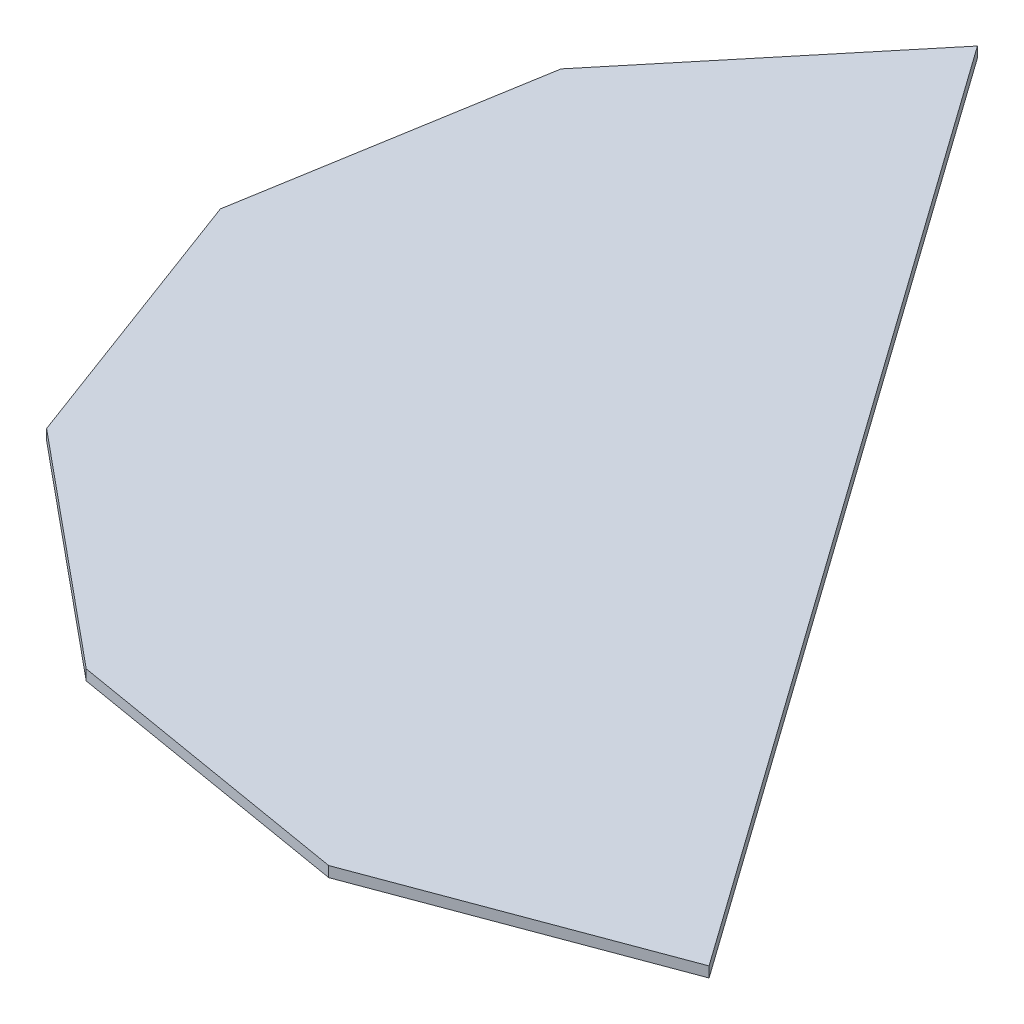
ISO-10303-21;
HEADER;
FILE_DESCRIPTION(('STEP AP214'),'2;1');
FILE_NAME('part.step','',(''),(''),'','','');
FILE_SCHEMA(('AUTOMOTIVE_DESIGN { 1 0 10303 214 1 1 1 1 }'));
ENDSEC;
DATA;
#1=APPLICATION_CONTEXT('core data for automotive mechanical design processes');
#2=APPLICATION_PROTOCOL_DEFINITION('international standard','automotive_design',2000,#1);
#3=PRODUCT_CONTEXT('',#1,'mechanical');
#4=PRODUCT('Part','Part','',(#3));
#5=PRODUCT_RELATED_PRODUCT_CATEGORY('part','',(#4));
#6=PRODUCT_DEFINITION_FORMATION('','',#4);
#7=PRODUCT_DEFINITION_CONTEXT('part definition',#1,'design');
#8=PRODUCT_DEFINITION('design','',#6,#7);
#9=PRODUCT_DEFINITION_SHAPE('','',#8);
#10=(LENGTH_UNIT() NAMED_UNIT(*) SI_UNIT(.MILLI.,.METRE.));
#11=(NAMED_UNIT(*) PLANE_ANGLE_UNIT() SI_UNIT($,.RADIAN.));
#12=(NAMED_UNIT(*) SI_UNIT($,.STERADIAN.) SOLID_ANGLE_UNIT());
#13=UNCERTAINTY_MEASURE_WITH_UNIT(LENGTH_MEASURE(1.E-05),#10,'distance_accuracy_value','');
#14=(GEOMETRIC_REPRESENTATION_CONTEXT(3) GLOBAL_UNCERTAINTY_ASSIGNED_CONTEXT((#13)) GLOBAL_UNIT_ASSIGNED_CONTEXT((#10,
#11,#12)) REPRESENTATION_CONTEXT('',''));
#15=CARTESIAN_POINT('',(0.,0.,0.));
#16=DIRECTION('',(0.,0.,1.));
#17=DIRECTION('',(1.,0.,0.));
#18=AXIS2_PLACEMENT_3D('',#15,#16,#17);
#19=CARTESIAN_POINT('',(-88.3698744190416,2.794,-124.163300919244));
#20=DIRECTION('',(-0.814719822304754,0.,0.579854819022581));
#21=DIRECTION('',(0.579854819022581,0.,0.814719822304754));
#22=AXIS2_PLACEMENT_3D('',#19,#20,#21);
#23=PLANE('',#22);
#24=DIRECTION('',(-0.579854819022581,0.,-0.814719822304754));
#25=VECTOR('',#24,1.);
#26=CARTESIAN_POINT('',(-88.3698744190416,0.,-124.163300919244));
#27=LINE('',#26,#25);
#28=CARTESIAN_POINT('',(88.3698744190412,0.,124.163300919245));
#29=VERTEX_POINT('',#28);
#30=CARTESIAN_POINT('',(-88.3698744190416,0.,-124.163300919244));
#31=VERTEX_POINT('',#30);
#32=EDGE_CURVE('E134',#29,#31,#27,.T.);
#33=ORIENTED_EDGE('',*,*,#32,.T.);
#34=DIRECTION('',(0.,-1.,0.));
#35=VECTOR('',#34,1.);
#36=CARTESIAN_POINT('',(-88.3698744190416,2.794,-124.163300919244));
#37=LINE('',#36,#35);
#38=CARTESIAN_POINT('',(-88.3698744190416,2.794,-124.163300919244));
#39=VERTEX_POINT('',#38);
#40=EDGE_CURVE('E11',#39,#31,#37,.T.);
#41=ORIENTED_EDGE('',*,*,#40,.F.);
#42=DIRECTION('',(-0.579854819022581,0.,-0.814719822304754));
#43=VECTOR('',#42,1.);
#44=CARTESIAN_POINT('',(-88.3698744190416,2.794,-124.163300919244));
#45=LINE('',#44,#43);
#46=CARTESIAN_POINT('',(88.3698744190412,2.794,124.163300919245));
#47=VERTEX_POINT('',#46);
#48=EDGE_CURVE('E153',#47,#39,#45,.T.);
#49=ORIENTED_EDGE('',*,*,#48,.F.);
#50=DIRECTION('',(0.,-1.,0.));
#51=VECTOR('',#50,1.);
#52=CARTESIAN_POINT('',(88.3698744190412,2.794,124.163300919245));
#53=LINE('',#52,#51);
#54=EDGE_CURVE('E130',#47,#29,#53,.T.);
#55=ORIENTED_EDGE('',*,*,#54,.T.);
#56=EDGE_LOOP('',(#33,#41,#49,#55));
#57=FACE_BOUND('',#56,.T.);
#58=ADVANCED_FACE('F39',(#57),#23,.F.);
#59=CARTESIAN_POINT('',(-88.3698744190416,2.794,-124.163300919244));
#60=DIRECTION('',(0.770961751627096,0.,0.636881446996283));
#61=DIRECTION('',(0.636881446996284,0.,-0.770961751627096));
#62=AXIS2_PLACEMENT_3D('',#59,#60,#61);
#63=PLANE('',#62);
#64=DIRECTION('',(-0.636881446996284,0.,0.770961751627096));
#65=VECTOR('',#64,1.);
#66=CARTESIAN_POINT('',(-88.3698744190416,0.,-124.163300919244));
#67=LINE('',#66,#65);
#68=CARTESIAN_POINT('',(-138.612206635752,0.,-63.3436356042775));
#69=VERTEX_POINT('',#68);
#70=EDGE_CURVE('E138',#31,#69,#67,.T.);
#71=ORIENTED_EDGE('',*,*,#70,.T.);
#72=DIRECTION('',(0.,-1.,0.));
#73=VECTOR('',#72,1.);
#74=CARTESIAN_POINT('',(-138.612206635752,2.794,-63.3436356042775));
#75=LINE('',#74,#73);
#76=CARTESIAN_POINT('',(-138.612206635752,2.794,-63.3436356042775));
#77=VERTEX_POINT('',#76);
#78=EDGE_CURVE('E48',#77,#69,#75,.T.);
#79=ORIENTED_EDGE('',*,*,#78,.F.);
#80=DIRECTION('',(-0.636881446996284,0.,0.770961751627096));
#81=VECTOR('',#80,1.);
#82=CARTESIAN_POINT('',(-88.3698744190416,2.794,-124.163300919244));
#83=LINE('',#82,#81);
#84=EDGE_CURVE('E96',#39,#77,#83,.T.);
#85=ORIENTED_EDGE('',*,*,#84,.F.);
#86=ORIENTED_EDGE('',*,*,#40,.T.);
#87=EDGE_LOOP('',(#71,#79,#85,#86));
#88=FACE_BOUND('',#87,.T.);
#89=ADVANCED_FACE('F187',(#88),#63,.F.);
#90=CARTESIAN_POINT('',(-138.612206635752,2.794,-63.3436356042775));
#91=DIRECTION('',(0.986113185753355,0.,0.166074636484229));
#92=DIRECTION('',(0.166074636484229,0.,-0.986113185753355));
#93=AXIS2_PLACEMENT_3D('',#90,#91,#92);
#94=PLANE('',#93);
#95=DIRECTION('',(-0.166074636484229,0.,0.986113185753355));
#96=VECTOR('',#95,1.);
#97=CARTESIAN_POINT('',(-138.612206635752,0.,-63.3436356042775));
#98=LINE('',#97,#96);
#99=CARTESIAN_POINT('',(-151.713510023318,0.,14.4489057165076));
#100=VERTEX_POINT('',#99);
#101=EDGE_CURVE('E141',#69,#100,#98,.T.);
#102=ORIENTED_EDGE('',*,*,#101,.T.);
#103=DIRECTION('',(0.,-1.,0.));
#104=VECTOR('',#103,1.);
#105=CARTESIAN_POINT('',(-151.713510023318,2.794,14.4489057165076));
#106=LINE('',#105,#104);
#107=CARTESIAN_POINT('',(-151.713510023318,2.794,14.4489057165076));
#108=VERTEX_POINT('',#107);
#109=EDGE_CURVE('E160',#108,#100,#106,.T.);
#110=ORIENTED_EDGE('',*,*,#109,.F.);
#111=DIRECTION('',(-0.166074636484229,0.,0.986113185753355));
#112=VECTOR('',#111,1.);
#113=CARTESIAN_POINT('',(-138.612206635752,2.794,-63.3436356042775));
#114=LINE('',#113,#112);
#115=EDGE_CURVE('E170',#77,#108,#114,.T.);
#116=ORIENTED_EDGE('',*,*,#115,.F.);
#117=ORIENTED_EDGE('',*,*,#78,.T.);
#118=EDGE_LOOP('',(#102,#110,#116,#117));
#119=FACE_BOUND('',#118,.T.);
#120=ADVANCED_FACE('F168',(#119),#94,.F.);
#121=CARTESIAN_POINT('',(-151.713510023318,2.794,14.4489057165076));
#122=DIRECTION('',(0.937036388111323,0.,-0.349231738757069));
#123=DIRECTION('',(-0.349231738757069,0.,-0.937036388111323));
#124=AXIS2_PLACEMENT_3D('',#121,#122,#123);
#125=PLANE('',#124);
#126=DIRECTION('',(0.349231738757069,0.,0.937036388111323));
#127=VECTOR('',#126,1.);
#128=CARTESIAN_POINT('',(-151.713510023318,0.,14.4489057165076));
#129=LINE('',#128,#127);
#130=CARTESIAN_POINT('',(-124.163300919245,0.,88.369874419041));
#131=VERTEX_POINT('',#130);
#132=EDGE_CURVE('E144',#100,#131,#129,.T.);
#133=ORIENTED_EDGE('',*,*,#132,.T.);
#134=DIRECTION('',(0.,-1.,0.));
#135=VECTOR('',#134,1.);
#136=CARTESIAN_POINT('',(-124.163300919245,2.794,88.369874419041));
#137=LINE('',#136,#135);
#138=CARTESIAN_POINT('',(-124.163300919245,2.794,88.369874419041));
#139=VERTEX_POINT('',#138);
#140=EDGE_CURVE('E123',#139,#131,#137,.T.);
#141=ORIENTED_EDGE('',*,*,#140,.F.);
#142=DIRECTION('',(0.349231738757069,0.,0.937036388111323));
#143=VECTOR('',#142,1.);
#144=CARTESIAN_POINT('',(-151.713510023318,2.794,14.4489057165076));
#145=LINE('',#144,#143);
#146=EDGE_CURVE('E112',#108,#139,#145,.T.);
#147=ORIENTED_EDGE('',*,*,#146,.F.);
#148=ORIENTED_EDGE('',*,*,#109,.T.);
#149=EDGE_LOOP('',(#133,#141,#147,#148));
#150=FACE_BOUND('',#149,.T.);
#151=ADVANCED_FACE('F176',(#150),#125,.F.);
#152=CARTESIAN_POINT('',(-124.163300919245,2.794,88.369874419041));
#153=DIRECTION('',(0.636881446996285,0.,-0.770961751627095));
#154=DIRECTION('',(-0.770961751627095,0.,-0.636881446996285));
#155=AXIS2_PLACEMENT_3D('',#152,#153,#154);
#156=PLANE('',#155);
#157=DIRECTION('',(0.770961751627095,0.,0.636881446996285));
#158=VECTOR('',#157,1.);
#159=CARTESIAN_POINT('',(-124.163300919245,0.,88.369874419041));
#160=LINE('',#159,#158);
#161=CARTESIAN_POINT('',(-63.343635604277,0.,138.612206635753));
#162=VERTEX_POINT('',#161);
#163=EDGE_CURVE('E121',#131,#162,#160,.T.);
#164=ORIENTED_EDGE('',*,*,#163,.T.);
#165=DIRECTION('',(0.,-1.,0.));
#166=VECTOR('',#165,1.);
#167=CARTESIAN_POINT('',(-63.343635604277,2.794,138.612206635753));
#168=LINE('',#167,#166);
#169=CARTESIAN_POINT('',(-63.343635604277,2.794,138.612206635753));
#170=VERTEX_POINT('',#169);
#171=EDGE_CURVE('E118',#170,#162,#168,.T.);
#172=ORIENTED_EDGE('',*,*,#171,.F.);
#173=DIRECTION('',(0.770961751627095,0.,0.636881446996285));
#174=VECTOR('',#173,1.);
#175=CARTESIAN_POINT('',(-124.163300919245,2.794,88.369874419041));
#176=LINE('',#175,#174);
#177=EDGE_CURVE('E106',#139,#170,#176,.T.);
#178=ORIENTED_EDGE('',*,*,#177,.F.);
#179=ORIENTED_EDGE('',*,*,#140,.T.);
#180=EDGE_LOOP('',(#164,#172,#178,#179));
#181=FACE_BOUND('',#180,.T.);
#182=ADVANCED_FACE('F119',(#181),#156,.F.);
#183=CARTESIAN_POINT('',(-63.343635604277,2.794,138.612206635753));
#184=DIRECTION('',(0.166074636484226,0.,-0.986113185753356));
#185=DIRECTION('',(-0.986113185753356,0.,-0.166074636484226));
#186=AXIS2_PLACEMENT_3D('',#183,#184,#185);
#187=PLANE('',#186);
#188=DIRECTION('',(0.986113185753356,0.,0.166074636484226));
#189=VECTOR('',#188,1.);
#190=CARTESIAN_POINT('',(-63.343635604277,0.,138.612206635753));
#191=LINE('',#190,#189);
#192=CARTESIAN_POINT('',(14.4489057165081,0.,151.713510023318));
#193=VERTEX_POINT('',#192);
#194=EDGE_CURVE('E82',#162,#193,#191,.T.);
#195=ORIENTED_EDGE('',*,*,#194,.T.);
#196=DIRECTION('',(0.,-1.,0.));
#197=VECTOR('',#196,1.);
#198=CARTESIAN_POINT('',(14.4489057165081,2.794,151.713510023318));
#199=LINE('',#198,#197);
#200=CARTESIAN_POINT('',(14.4489057165081,2.794,151.713510023318));
#201=VERTEX_POINT('',#200);
#202=EDGE_CURVE('E124',#201,#193,#199,.T.);
#203=ORIENTED_EDGE('',*,*,#202,.F.);
#204=DIRECTION('',(0.986113185753356,0.,0.166074636484226));
#205=VECTOR('',#204,1.);
#206=CARTESIAN_POINT('',(-63.343635604277,2.794,138.612206635753));
#207=LINE('',#206,#205);
#208=EDGE_CURVE('E110',#170,#201,#207,.T.);
#209=ORIENTED_EDGE('',*,*,#208,.F.);
#210=ORIENTED_EDGE('',*,*,#171,.T.);
#211=EDGE_LOOP('',(#195,#203,#209,#210));
#212=FACE_BOUND('',#211,.T.);
#213=ADVANCED_FACE('F126',(#212),#187,.F.);
#214=CARTESIAN_POINT('',(14.4489057165081,2.794,151.713510023318));
#215=DIRECTION('',(-0.349231738757072,0.,-0.937036388111322));
#216=DIRECTION('',(-0.937036388111322,0.,0.349231738757072));
#217=AXIS2_PLACEMENT_3D('',#214,#215,#216);
#218=PLANE('',#217);
#219=DIRECTION('',(0.937036388111322,0.,-0.349231738757072));
#220=VECTOR('',#219,1.);
#221=CARTESIAN_POINT('',(14.4489057165081,0.,151.713510023318));
#222=LINE('',#221,#220);
#223=EDGE_CURVE('E88',#193,#29,#222,.T.);
#224=ORIENTED_EDGE('',*,*,#223,.T.);
#225=ORIENTED_EDGE('',*,*,#54,.F.);
#226=DIRECTION('',(0.937036388111322,0.,-0.349231738757072));
#227=VECTOR('',#226,1.);
#228=CARTESIAN_POINT('',(14.4489057165081,2.794,151.713510023318));
#229=LINE('',#228,#227);
#230=EDGE_CURVE('E56',#201,#47,#229,.T.);
#231=ORIENTED_EDGE('',*,*,#230,.F.);
#232=ORIENTED_EDGE('',*,*,#202,.T.);
#233=EDGE_LOOP('',(#224,#225,#231,#232));
#234=FACE_BOUND('',#233,.T.);
#235=ADVANCED_FACE('F201',(#234),#218,.F.);
#236=CARTESIAN_POINT('',(0.,2.794,0.));
#237=DIRECTION('',(0.,1.,0.));
#238=DIRECTION('',(0.,0.,1.));
#239=AXIS2_PLACEMENT_3D('',#236,#237,#238);
#240=PLANE('',#239);
#241=ORIENTED_EDGE('',*,*,#48,.T.);
#242=ORIENTED_EDGE('',*,*,#84,.T.);
#243=ORIENTED_EDGE('',*,*,#115,.T.);
#244=ORIENTED_EDGE('',*,*,#146,.T.);
#245=ORIENTED_EDGE('',*,*,#177,.T.);
#246=ORIENTED_EDGE('',*,*,#208,.T.);
#247=ORIENTED_EDGE('',*,*,#230,.T.);
#248=EDGE_LOOP('',(#241,#242,#243,#244,#245,#246,#247));
#249=FACE_BOUND('',#248,.T.);
#250=ADVANCED_FACE('F108',(#249),#240,.T.);
#251=CARTESIAN_POINT('',(0.,0.,0.));
#252=DIRECTION('',(0.,1.,0.));
#253=DIRECTION('',(0.,0.,1.));
#254=AXIS2_PLACEMENT_3D('',#251,#252,#253);
#255=PLANE('',#254);
#256=ORIENTED_EDGE('',*,*,#32,.F.);
#257=ORIENTED_EDGE('',*,*,#223,.F.);
#258=ORIENTED_EDGE('',*,*,#194,.F.);
#259=ORIENTED_EDGE('',*,*,#163,.F.);
#260=ORIENTED_EDGE('',*,*,#132,.F.);
#261=ORIENTED_EDGE('',*,*,#101,.F.);
#262=ORIENTED_EDGE('',*,*,#70,.F.);
#263=EDGE_LOOP('',(#256,#257,#258,#259,#260,#261,#262));
#264=FACE_BOUND('',#263,.T.);
#265=ADVANCED_FACE('F174',(#264),#255,.F.);
#266=CLOSED_SHELL('',(#58,#89,#120,#151,#182,#213,#235,#250,#265));
#267=MANIFOLD_SOLID_BREP('B2',#266);
#268=ADVANCED_BREP_SHAPE_REPRESENTATION('',(#18,#267),#14);
#269=SHAPE_DEFINITION_REPRESENTATION(#9,#268);
ENDSEC;
END-ISO-10303-21;
